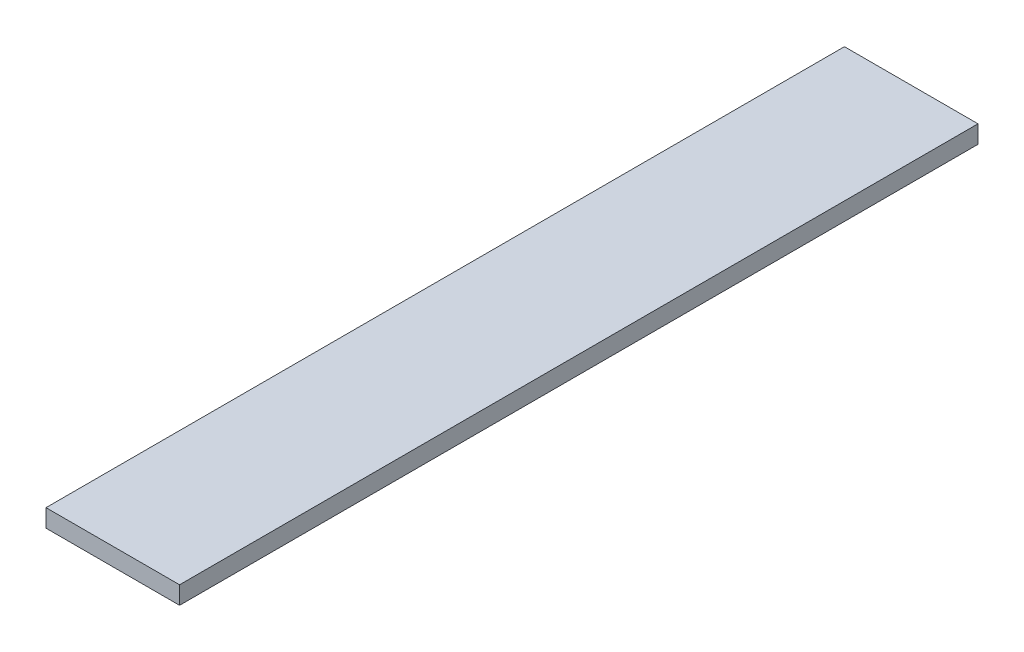
ISO-10303-21;
HEADER;
FILE_DESCRIPTION(('STEP AP214'),'2;1');
FILE_NAME('part.step','',(''),(''),'','','');
FILE_SCHEMA(('AUTOMOTIVE_DESIGN { 1 0 10303 214 1 1 1 1 }'));
ENDSEC;
DATA;
#1=APPLICATION_CONTEXT('core data for automotive mechanical design processes');
#2=APPLICATION_PROTOCOL_DEFINITION('international standard','automotive_design',2000,#1);
#3=PRODUCT_CONTEXT('',#1,'mechanical');
#4=PRODUCT('Part','Part','',(#3));
#5=PRODUCT_RELATED_PRODUCT_CATEGORY('part','',(#4));
#6=PRODUCT_DEFINITION_FORMATION('','',#4);
#7=PRODUCT_DEFINITION_CONTEXT('part definition',#1,'design');
#8=PRODUCT_DEFINITION('design','',#6,#7);
#9=PRODUCT_DEFINITION_SHAPE('','',#8);
#10=(LENGTH_UNIT() NAMED_UNIT(*) SI_UNIT(.MILLI.,.METRE.));
#11=(NAMED_UNIT(*) PLANE_ANGLE_UNIT() SI_UNIT($,.RADIAN.));
#12=(NAMED_UNIT(*) SI_UNIT($,.STERADIAN.) SOLID_ANGLE_UNIT());
#13=UNCERTAINTY_MEASURE_WITH_UNIT(LENGTH_MEASURE(1.E-05),#10,'distance_accuracy_value','');
#14=(GEOMETRIC_REPRESENTATION_CONTEXT(3) GLOBAL_UNCERTAINTY_ASSIGNED_CONTEXT((#13)) GLOBAL_UNIT_ASSIGNED_CONTEXT((#10,
#11,#12)) REPRESENTATION_CONTEXT('',''));
#15=CARTESIAN_POINT('',(0.,0.,0.));
#16=DIRECTION('',(0.,0.,1.));
#17=DIRECTION('',(1.,0.,0.));
#18=AXIS2_PLACEMENT_3D('',#15,#16,#17);
#19=CARTESIAN_POINT('',(0.,38.1,0.));
#20=DIRECTION('',(1.,0.,0.));
#21=DIRECTION('',(0.,0.,-1.));
#22=AXIS2_PLACEMENT_3D('',#19,#20,#21);
#23=PLANE('',#22);
#24=DIRECTION('',(0.,0.,1.));
#25=VECTOR('',#24,1.);
#26=CARTESIAN_POINT('',(0.,0.,0.));
#27=LINE('',#26,#25);
#28=CARTESIAN_POINT('',(0.,0.,0.));
#29=VERTEX_POINT('',#28);
#30=CARTESIAN_POINT('',(2.09188042996355E-13,0.,1708.15));
#31=VERTEX_POINT('',#30);
#32=EDGE_CURVE('E96',#29,#31,#27,.T.);
#33=ORIENTED_EDGE('',*,*,#32,.T.);
#34=DIRECTION('',(0.,-1.,0.));
#35=VECTOR('',#34,1.);
#36=CARTESIAN_POINT('',(2.09188042996355E-13,38.1,1708.15));
#37=LINE('',#36,#35);
#38=CARTESIAN_POINT('',(2.09188042996355E-13,38.1,1708.15));
#39=VERTEX_POINT('',#38);
#40=EDGE_CURVE('E11',#39,#31,#37,.T.);
#41=ORIENTED_EDGE('',*,*,#40,.F.);
#42=DIRECTION('',(0.,0.,1.));
#43=VECTOR('',#42,1.);
#44=CARTESIAN_POINT('',(0.,38.1,0.));
#45=LINE('',#44,#43);
#46=CARTESIAN_POINT('',(0.,38.1,0.));
#47=VERTEX_POINT('',#46);
#48=EDGE_CURVE('E84',#47,#39,#45,.T.);
#49=ORIENTED_EDGE('',*,*,#48,.F.);
#50=DIRECTION('',(0.,-1.,0.));
#51=VECTOR('',#50,1.);
#52=CARTESIAN_POINT('',(0.,38.1,0.));
#53=LINE('',#52,#51);
#54=EDGE_CURVE('E92',#47,#29,#53,.T.);
#55=ORIENTED_EDGE('',*,*,#54,.T.);
#56=EDGE_LOOP('',(#33,#41,#49,#55));
#57=FACE_BOUND('',#56,.T.);
#58=ADVANCED_FACE('F33',(#57),#23,.F.);
#59=CARTESIAN_POINT('',(2.09188042996355E-13,38.1,1708.15));
#60=DIRECTION('',(0.,0.,-1.));
#61=DIRECTION('',(-1.,0.,0.));
#62=AXIS2_PLACEMENT_3D('',#59,#60,#61);
#63=PLANE('',#62);
#64=DIRECTION('',(1.,0.,0.));
#65=VECTOR('',#64,1.);
#66=CARTESIAN_POINT('',(2.09188042996355E-13,0.,1708.15));
#67=LINE('',#66,#65);
#68=CARTESIAN_POINT('',(285.75,0.,1708.15));
#69=VERTEX_POINT('',#68);
#70=EDGE_CURVE('E88',#31,#69,#67,.T.);
#71=ORIENTED_EDGE('',*,*,#70,.T.);
#72=DIRECTION('',(0.,-1.,0.));
#73=VECTOR('',#72,1.);
#74=CARTESIAN_POINT('',(285.75,38.1,1708.15));
#75=LINE('',#74,#73);
#76=CARTESIAN_POINT('',(285.75,38.1,1708.15));
#77=VERTEX_POINT('',#76);
#78=EDGE_CURVE('E41',#77,#69,#75,.T.);
#79=ORIENTED_EDGE('',*,*,#78,.F.);
#80=DIRECTION('',(1.,0.,0.));
#81=VECTOR('',#80,1.);
#82=CARTESIAN_POINT('',(2.09188042996355E-13,38.1,1708.15));
#83=LINE('',#82,#81);
#84=EDGE_CURVE('E79',#39,#77,#83,.T.);
#85=ORIENTED_EDGE('',*,*,#84,.F.);
#86=ORIENTED_EDGE('',*,*,#40,.T.);
#87=EDGE_LOOP('',(#71,#79,#85,#86));
#88=FACE_BOUND('',#87,.T.);
#89=ADVANCED_FACE('F87',(#88),#63,.F.);
#90=CARTESIAN_POINT('',(285.75,38.1,0.));
#91=DIRECTION('',(-1.,0.,0.));
#92=DIRECTION('',(0.,0.,1.));
#93=AXIS2_PLACEMENT_3D('',#90,#91,#92);
#94=PLANE('',#93);
#95=DIRECTION('',(0.,0.,-1.));
#96=VECTOR('',#95,1.);
#97=CARTESIAN_POINT('',(285.75,0.,0.));
#98=LINE('',#97,#96);
#99=CARTESIAN_POINT('',(285.75,0.,0.));
#100=VERTEX_POINT('',#99);
#101=EDGE_CURVE('E66',#69,#100,#98,.T.);
#102=ORIENTED_EDGE('',*,*,#101,.T.);
#103=DIRECTION('',(0.,-1.,0.));
#104=VECTOR('',#103,1.);
#105=CARTESIAN_POINT('',(285.75,38.1,0.));
#106=LINE('',#105,#104);
#107=CARTESIAN_POINT('',(285.75,38.1,0.));
#108=VERTEX_POINT('',#107);
#109=EDGE_CURVE('E89',#108,#100,#106,.T.);
#110=ORIENTED_EDGE('',*,*,#109,.F.);
#111=DIRECTION('',(0.,0.,-1.));
#112=VECTOR('',#111,1.);
#113=CARTESIAN_POINT('',(285.75,38.1,0.));
#114=LINE('',#113,#112);
#115=EDGE_CURVE('E82',#77,#108,#114,.T.);
#116=ORIENTED_EDGE('',*,*,#115,.F.);
#117=ORIENTED_EDGE('',*,*,#78,.T.);
#118=EDGE_LOOP('',(#102,#110,#116,#117));
#119=FACE_BOUND('',#118,.T.);
#120=ADVANCED_FACE('F90',(#119),#94,.F.);
#121=CARTESIAN_POINT('',(0.,38.1,0.));
#122=DIRECTION('',(0.,0.,1.));
#123=DIRECTION('',(1.,0.,0.));
#124=AXIS2_PLACEMENT_3D('',#121,#122,#123);
#125=PLANE('',#124);
#126=DIRECTION('',(-1.,0.,0.));
#127=VECTOR('',#126,1.);
#128=CARTESIAN_POINT('',(0.,0.,0.));
#129=LINE('',#128,#127);
#130=EDGE_CURVE('E72',#100,#29,#129,.T.);
#131=ORIENTED_EDGE('',*,*,#130,.T.);
#132=ORIENTED_EDGE('',*,*,#54,.F.);
#133=DIRECTION('',(-1.,0.,0.));
#134=VECTOR('',#133,1.);
#135=CARTESIAN_POINT('',(0.,38.1,0.));
#136=LINE('',#135,#134);
#137=EDGE_CURVE('E49',#108,#47,#136,.T.);
#138=ORIENTED_EDGE('',*,*,#137,.F.);
#139=ORIENTED_EDGE('',*,*,#109,.T.);
#140=EDGE_LOOP('',(#131,#132,#138,#139));
#141=FACE_BOUND('',#140,.T.);
#142=ADVANCED_FACE('F103',(#141),#125,.F.);
#143=CARTESIAN_POINT('',(0.,38.1,0.));
#144=DIRECTION('',(0.,1.,0.));
#145=DIRECTION('',(0.,0.,1.));
#146=AXIS2_PLACEMENT_3D('',#143,#144,#145);
#147=PLANE('',#146);
#148=ORIENTED_EDGE('',*,*,#48,.T.);
#149=ORIENTED_EDGE('',*,*,#84,.T.);
#150=ORIENTED_EDGE('',*,*,#115,.T.);
#151=ORIENTED_EDGE('',*,*,#137,.T.);
#152=EDGE_LOOP('',(#148,#149,#150,#151));
#153=FACE_BOUND('',#152,.T.);
#154=ADVANCED_FACE('F80',(#153),#147,.T.);
#155=CARTESIAN_POINT('',(0.,0.,0.));
#156=DIRECTION('',(0.,1.,0.));
#157=DIRECTION('',(0.,0.,1.));
#158=AXIS2_PLACEMENT_3D('',#155,#156,#157);
#159=PLANE('',#158);
#160=ORIENTED_EDGE('',*,*,#32,.F.);
#161=ORIENTED_EDGE('',*,*,#130,.F.);
#162=ORIENTED_EDGE('',*,*,#101,.F.);
#163=ORIENTED_EDGE('',*,*,#70,.F.);
#164=EDGE_LOOP('',(#160,#161,#162,#163));
#165=FACE_BOUND('',#164,.T.);
#166=ADVANCED_FACE('F106',(#165),#159,.F.);
#167=CLOSED_SHELL('',(#58,#89,#120,#142,#154,#166));
#168=MANIFOLD_SOLID_BREP('B2',#167);
#169=ADVANCED_BREP_SHAPE_REPRESENTATION('',(#18,#168),#14);
#170=SHAPE_DEFINITION_REPRESENTATION(#9,#169);
ENDSEC;
END-ISO-10303-21;
